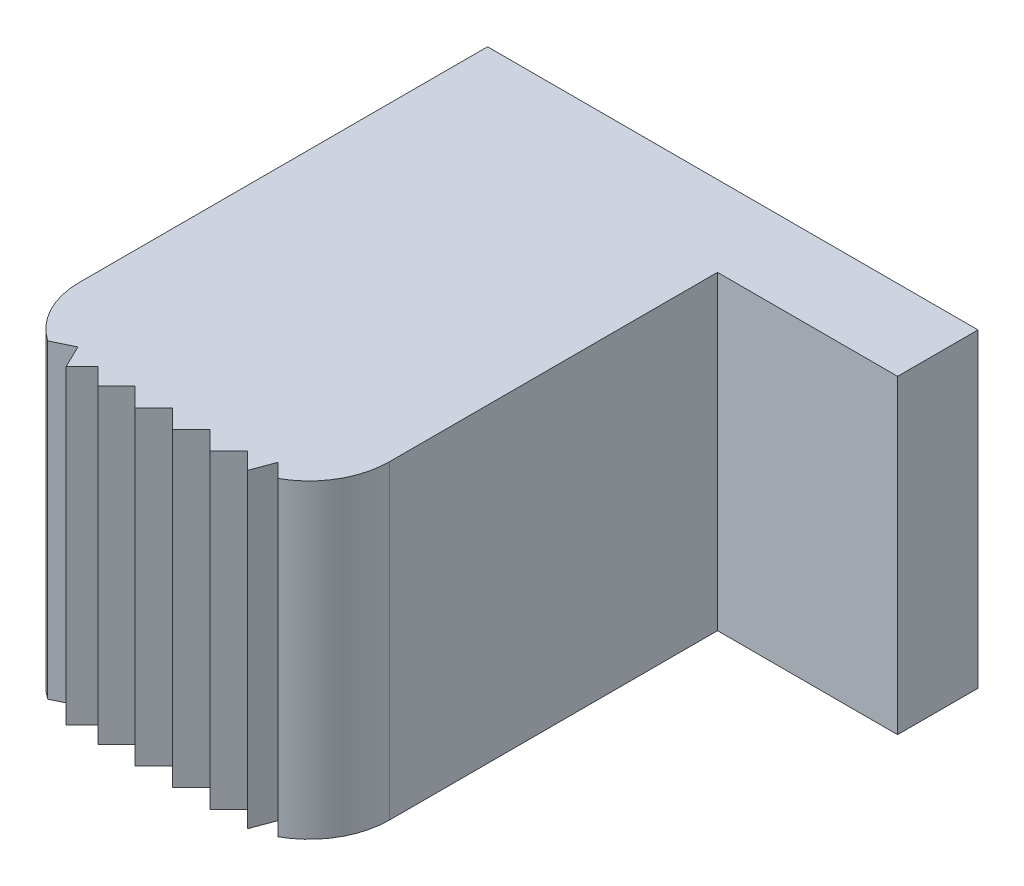
ISO-10303-21;
HEADER;
FILE_DESCRIPTION(('STEP AP214'),'2;1');
FILE_NAME('part.step','',(''),(''),'','','');
FILE_SCHEMA(('AUTOMOTIVE_DESIGN { 1 0 10303 214 1 1 1 1 }'));
ENDSEC;
DATA;
#1=APPLICATION_CONTEXT('core data for automotive mechanical design processes');
#2=APPLICATION_PROTOCOL_DEFINITION('international standard','automotive_design',2000,#1);
#3=PRODUCT_CONTEXT('',#1,'mechanical');
#4=PRODUCT('Part','Part','',(#3));
#5=PRODUCT_RELATED_PRODUCT_CATEGORY('part','',(#4));
#6=PRODUCT_DEFINITION_FORMATION('','',#4);
#7=PRODUCT_DEFINITION_CONTEXT('part definition',#1,'design');
#8=PRODUCT_DEFINITION('design','',#6,#7);
#9=PRODUCT_DEFINITION_SHAPE('','',#8);
#10=(LENGTH_UNIT() NAMED_UNIT(*) SI_UNIT(.MILLI.,.METRE.));
#11=(NAMED_UNIT(*) PLANE_ANGLE_UNIT() SI_UNIT($,.RADIAN.));
#12=(NAMED_UNIT(*) SI_UNIT($,.STERADIAN.) SOLID_ANGLE_UNIT());
#13=UNCERTAINTY_MEASURE_WITH_UNIT(LENGTH_MEASURE(1.E-05),#10,'distance_accuracy_value','');
#14=(GEOMETRIC_REPRESENTATION_CONTEXT(3) GLOBAL_UNCERTAINTY_ASSIGNED_CONTEXT((#13)) GLOBAL_UNIT_ASSIGNED_CONTEXT((#10,
#11,#12)) REPRESENTATION_CONTEXT('',''));
#15=CARTESIAN_POINT('',(0.,0.,0.));
#16=DIRECTION('',(0.,0.,1.));
#17=DIRECTION('',(1.,0.,0.));
#18=AXIS2_PLACEMENT_3D('',#15,#16,#17);
#19=CARTESIAN_POINT('',(-1.1200687266404,-1.93,5.84761240376454));
#20=DIRECTION('',(-0.707106781186547,0.,-0.707106781186548));
#21=DIRECTION('',(-0.707106781186548,0.,0.707106781186547));
#22=AXIS2_PLACEMENT_3D('',#19,#20,#21);
#23=PLANE('',#22);
#24=DIRECTION('',(0.,1.,0.));
#25=VECTOR('',#24,1.);
#26=CARTESIAN_POINT('',(-1.35245632287586,-1.93,6.08));
#27=LINE('',#26,#25);
#28=CARTESIAN_POINT('',(-1.35245632287586,1.93,6.08));
#29=VERTEX_POINT('',#28);
#30=CARTESIAN_POINT('',(-1.35245632287586,-1.93,6.08));
#31=VERTEX_POINT('',#30);
#32=EDGE_CURVE('E214',#29,#31,#27,.F.);
#33=ORIENTED_EDGE('',*,*,#32,.T.);
#34=DIRECTION('',(-0.707106781186548,0.,0.707106781186547));
#35=VECTOR('',#34,1.);
#36=CARTESIAN_POINT('',(-1.1200687266404,-1.93,5.84761240376454));
#37=LINE('',#36,#35);
#38=CARTESIAN_POINT('',(-1.1200687266404,-1.93,5.84761240376454));
#39=VERTEX_POINT('',#38);
#40=EDGE_CURVE('E206',#39,#31,#37,.T.);
#41=ORIENTED_EDGE('',*,*,#40,.F.);
#42=DIRECTION('',(0.,1.,0.));
#43=VECTOR('',#42,1.);
#44=CARTESIAN_POINT('',(-1.1200687266404,-1.93,5.84761240376454));
#45=LINE('',#44,#43);
#46=CARTESIAN_POINT('',(-1.1200687266404,1.93,5.84761240376454));
#47=VERTEX_POINT('',#46);
#48=EDGE_CURVE('E199',#39,#47,#45,.T.);
#49=ORIENTED_EDGE('',*,*,#48,.T.);
#50=DIRECTION('',(-0.707106781186548,0.,0.707106781186547));
#51=VECTOR('',#50,1.);
#52=CARTESIAN_POINT('',(-1.1200687266404,1.93,5.84761240376454));
#53=LINE('',#52,#51);
#54=EDGE_CURVE('E208',#29,#47,#53,.F.);
#55=ORIENTED_EDGE('',*,*,#54,.F.);
#56=EDGE_LOOP('',(#33,#41,#49,#55));
#57=FACE_BOUND('',#56,.T.);
#58=ADVANCED_FACE('F16',(#57),#23,.F.);
#59=CARTESIAN_POINT('',(-0.887681130404932,-1.93,6.08));
#60=DIRECTION('',(0.707106781186546,0.,-0.707106781186549));
#61=DIRECTION('',(-0.707106781186549,0.,-0.707106781186546));
#62=AXIS2_PLACEMENT_3D('',#59,#60,#61);
#63=PLANE('',#62);
#64=ORIENTED_EDGE('',*,*,#48,.F.);
#65=DIRECTION('',(-0.707106781186549,0.,-0.707106781186546));
#66=VECTOR('',#65,1.);
#67=CARTESIAN_POINT('',(-0.887681130404932,-1.93,6.08));
#68=LINE('',#67,#66);
#69=CARTESIAN_POINT('',(-0.887681130404932,-1.93,6.08));
#70=VERTEX_POINT('',#69);
#71=EDGE_CURVE('E203',#70,#39,#68,.T.);
#72=ORIENTED_EDGE('',*,*,#71,.F.);
#73=DIRECTION('',(0.,1.,0.));
#74=VECTOR('',#73,1.);
#75=CARTESIAN_POINT('',(-0.887681130404932,-1.93,6.08));
#76=LINE('',#75,#74);
#77=CARTESIAN_POINT('',(-0.887681130404932,1.93,6.08));
#78=VERTEX_POINT('',#77);
#79=EDGE_CURVE('E226',#70,#78,#76,.T.);
#80=ORIENTED_EDGE('',*,*,#79,.T.);
#81=DIRECTION('',(-0.707106781186549,0.,-0.707106781186546));
#82=VECTOR('',#81,1.);
#83=CARTESIAN_POINT('',(-0.887681130404932,1.93,6.08));
#84=LINE('',#83,#82);
#85=EDGE_CURVE('E202',#47,#78,#84,.F.);
#86=ORIENTED_EDGE('',*,*,#85,.F.);
#87=EDGE_LOOP('',(#64,#72,#80,#86));
#88=FACE_BOUND('',#87,.T.);
#89=ADVANCED_FACE('F517',(#88),#63,.F.);
#90=CARTESIAN_POINT('',(-1.35245632287586,-1.93,6.08));
#91=DIRECTION('',(0.707106781186548,0.,-0.707106781186548));
#92=DIRECTION('',(-0.707106781186548,0.,-0.707106781186548));
#93=AXIS2_PLACEMENT_3D('',#90,#91,#92);
#94=PLANE('',#93);
#95=DIRECTION('',(0.,1.,0.));
#96=VECTOR('',#95,1.);
#97=CARTESIAN_POINT('',(-1.58484391911133,-1.93,5.84761240376454));
#98=LINE('',#97,#96);
#99=CARTESIAN_POINT('',(-1.58484391911133,1.93,5.84761240376454));
#100=VERTEX_POINT('',#99);
#101=CARTESIAN_POINT('',(-1.58484391911133,-1.93,5.84761240376454));
#102=VERTEX_POINT('',#101);
#103=EDGE_CURVE('E241',#100,#102,#98,.F.);
#104=ORIENTED_EDGE('',*,*,#103,.T.);
#105=DIRECTION('',(-0.707106781186548,0.,-0.707106781186548));
#106=VECTOR('',#105,1.);
#107=CARTESIAN_POINT('',(-1.35245632287586,-1.93,6.08));
#108=LINE('',#107,#106);
#109=EDGE_CURVE('E217',#31,#102,#108,.T.);
#110=ORIENTED_EDGE('',*,*,#109,.F.);
#111=ORIENTED_EDGE('',*,*,#32,.F.);
#112=DIRECTION('',(-0.707106781186548,0.,-0.707106781186548));
#113=VECTOR('',#112,1.);
#114=CARTESIAN_POINT('',(-1.35245632287586,1.93,6.08));
#115=LINE('',#114,#113);
#116=EDGE_CURVE('E234',#100,#29,#115,.F.);
#117=ORIENTED_EDGE('',*,*,#116,.F.);
#118=EDGE_LOOP('',(#104,#110,#111,#117));
#119=FACE_BOUND('',#118,.T.);
#120=ADVANCED_FACE('F514',(#119),#94,.F.);
#121=CARTESIAN_POINT('',(-0.655293534169467,-1.93,5.84761240376454));
#122=DIRECTION('',(-0.707106781186547,0.,-0.707106781186548));
#123=DIRECTION('',(-0.707106781186548,0.,0.707106781186547));
#124=AXIS2_PLACEMENT_3D('',#121,#122,#123);
#125=PLANE('',#124);
#126=ORIENTED_EDGE('',*,*,#79,.F.);
#127=DIRECTION('',(-0.707106781186548,0.,0.707106781186547));
#128=VECTOR('',#127,1.);
#129=CARTESIAN_POINT('',(-0.655293534169467,-1.93,5.84761240376454));
#130=LINE('',#129,#128);
#131=CARTESIAN_POINT('',(-0.655293534169467,-1.93,5.84761240376454));
#132=VERTEX_POINT('',#131);
#133=EDGE_CURVE('E230',#132,#70,#130,.T.);
#134=ORIENTED_EDGE('',*,*,#133,.F.);
#135=DIRECTION('',(0.,1.,0.));
#136=VECTOR('',#135,1.);
#137=CARTESIAN_POINT('',(-0.655293534169467,-1.93,5.84761240376454));
#138=LINE('',#137,#136);
#139=CARTESIAN_POINT('',(-0.655293534169467,1.93,5.84761240376454));
#140=VERTEX_POINT('',#139);
#141=EDGE_CURVE('E253',#132,#140,#138,.T.);
#142=ORIENTED_EDGE('',*,*,#141,.T.);
#143=DIRECTION('',(-0.707106781186548,0.,0.707106781186547));
#144=VECTOR('',#143,1.);
#145=CARTESIAN_POINT('',(-0.655293534169467,1.93,5.84761240376454));
#146=LINE('',#145,#144);
#147=EDGE_CURVE('E229',#78,#140,#146,.F.);
#148=ORIENTED_EDGE('',*,*,#147,.F.);
#149=EDGE_LOOP('',(#126,#134,#142,#148));
#150=FACE_BOUND('',#149,.T.);
#151=ADVANCED_FACE('F510',(#150),#125,.F.);
#152=CARTESIAN_POINT('',(-1.58484391911133,-1.93,5.84761240376454));
#153=DIRECTION('',(-0.707106781186548,0.,-0.707106781186547));
#154=DIRECTION('',(-0.707106781186547,0.,0.707106781186548));
#155=AXIS2_PLACEMENT_3D('',#152,#153,#154);
#156=PLANE('',#155);
#157=DIRECTION('',(0.,1.,0.));
#158=VECTOR('',#157,1.);
#159=CARTESIAN_POINT('',(-1.81723151534679,-1.93,6.08));
#160=LINE('',#159,#158);
#161=CARTESIAN_POINT('',(-1.81723151534679,1.93,6.08));
#162=VERTEX_POINT('',#161);
#163=CARTESIAN_POINT('',(-1.81723151534679,-1.93,6.08));
#164=VERTEX_POINT('',#163);
#165=EDGE_CURVE('E268',#162,#164,#160,.F.);
#166=ORIENTED_EDGE('',*,*,#165,.T.);
#167=DIRECTION('',(-0.707106781186547,0.,0.707106781186548));
#168=VECTOR('',#167,1.);
#169=CARTESIAN_POINT('',(-1.58484391911133,-1.93,5.84761240376454));
#170=LINE('',#169,#168);
#171=EDGE_CURVE('E244',#102,#164,#170,.T.);
#172=ORIENTED_EDGE('',*,*,#171,.F.);
#173=ORIENTED_EDGE('',*,*,#103,.F.);
#174=DIRECTION('',(-0.707106781186547,0.,0.707106781186548));
#175=VECTOR('',#174,1.);
#176=CARTESIAN_POINT('',(-1.58484391911133,1.93,5.84761240376454));
#177=LINE('',#176,#175);
#178=EDGE_CURVE('E261',#162,#100,#177,.F.);
#179=ORIENTED_EDGE('',*,*,#178,.F.);
#180=EDGE_LOOP('',(#166,#172,#173,#179));
#181=FACE_BOUND('',#180,.T.);
#182=ADVANCED_FACE('F506',(#181),#156,.F.);
#183=CARTESIAN_POINT('',(-0.422905937934001,-1.93,6.08));
#184=DIRECTION('',(0.707106781186547,0.,-0.707106781186548));
#185=DIRECTION('',(-0.707106781186548,0.,-0.707106781186547));
#186=AXIS2_PLACEMENT_3D('',#183,#184,#185);
#187=PLANE('',#186);
#188=ORIENTED_EDGE('',*,*,#141,.F.);
#189=DIRECTION('',(-0.707106781186548,0.,-0.707106781186547));
#190=VECTOR('',#189,1.);
#191=CARTESIAN_POINT('',(-0.422905937934001,-1.93,6.08));
#192=LINE('',#191,#190);
#193=CARTESIAN_POINT('',(-0.422905937934001,-1.93,6.08));
#194=VERTEX_POINT('',#193);
#195=EDGE_CURVE('E257',#194,#132,#192,.T.);
#196=ORIENTED_EDGE('',*,*,#195,.F.);
#197=DIRECTION('',(0.,1.,0.));
#198=VECTOR('',#197,1.);
#199=CARTESIAN_POINT('',(-0.422905937934001,-1.93,6.08));
#200=LINE('',#199,#198);
#201=CARTESIAN_POINT('',(-0.422905937934001,1.93,6.08));
#202=VERTEX_POINT('',#201);
#203=EDGE_CURVE('E280',#194,#202,#200,.T.);
#204=ORIENTED_EDGE('',*,*,#203,.T.);
#205=DIRECTION('',(-0.707106781186548,0.,-0.707106781186547));
#206=VECTOR('',#205,1.);
#207=CARTESIAN_POINT('',(-0.422905937934001,1.93,6.08));
#208=LINE('',#207,#206);
#209=EDGE_CURVE('E256',#140,#202,#208,.F.);
#210=ORIENTED_EDGE('',*,*,#209,.F.);
#211=EDGE_LOOP('',(#188,#196,#204,#210));
#212=FACE_BOUND('',#211,.T.);
#213=ADVANCED_FACE('F502',(#212),#187,.F.);
#214=CARTESIAN_POINT('',(-1.81723151534679,-1.93,6.08));
#215=DIRECTION('',(0.707106781186548,0.,-0.707106781186547));
#216=DIRECTION('',(-0.707106781186547,0.,-0.707106781186548));
#217=AXIS2_PLACEMENT_3D('',#214,#215,#216);
#218=PLANE('',#217);
#219=DIRECTION('',(0.,1.,0.));
#220=VECTOR('',#219,1.);
#221=CARTESIAN_POINT('',(-2.02984114288925,-1.93,5.86739037245754));
#222=LINE('',#221,#220);
#223=CARTESIAN_POINT('',(-2.02984114288925,1.93,5.86739037245754));
#224=VERTEX_POINT('',#223);
#225=CARTESIAN_POINT('',(-2.02984114288925,-1.93,5.86739037245754));
#226=VERTEX_POINT('',#225);
#227=EDGE_CURVE('E295',#224,#226,#222,.F.);
#228=ORIENTED_EDGE('',*,*,#227,.T.);
#229=DIRECTION('',(-0.707106781186547,0.,-0.707106781186548));
#230=VECTOR('',#229,1.);
#231=CARTESIAN_POINT('',(-1.81723151534679,-1.93,6.08));
#232=LINE('',#231,#230);
#233=EDGE_CURVE('E271',#164,#226,#232,.T.);
#234=ORIENTED_EDGE('',*,*,#233,.F.);
#235=ORIENTED_EDGE('',*,*,#165,.F.);
#236=DIRECTION('',(-0.707106781186547,0.,-0.707106781186548));
#237=VECTOR('',#236,1.);
#238=CARTESIAN_POINT('',(-1.81723151534679,1.93,6.08));
#239=LINE('',#238,#237);
#240=EDGE_CURVE('E288',#224,#162,#239,.F.);
#241=ORIENTED_EDGE('',*,*,#240,.F.);
#242=EDGE_LOOP('',(#228,#234,#235,#241));
#243=FACE_BOUND('',#242,.T.);
#244=ADVANCED_FACE('F498',(#243),#218,.F.);
#245=CARTESIAN_POINT('',(-0.190518341698535,-1.93,5.84761240376454));
#246=DIRECTION('',(-0.707106781186546,0.,-0.707106781186549));
#247=DIRECTION('',(-0.707106781186549,0.,0.707106781186546));
#248=AXIS2_PLACEMENT_3D('',#245,#246,#247);
#249=PLANE('',#248);
#250=ORIENTED_EDGE('',*,*,#203,.F.);
#251=DIRECTION('',(-0.707106781186549,0.,0.707106781186546));
#252=VECTOR('',#251,1.);
#253=CARTESIAN_POINT('',(-0.190518341698535,-1.93,5.84761240376454));
#254=LINE('',#253,#252);
#255=CARTESIAN_POINT('',(-0.190518341698535,-1.93,5.84761240376454));
#256=VERTEX_POINT('',#255);
#257=EDGE_CURVE('E284',#256,#194,#254,.T.);
#258=ORIENTED_EDGE('',*,*,#257,.F.);
#259=DIRECTION('',(0.,1.,0.));
#260=VECTOR('',#259,1.);
#261=CARTESIAN_POINT('',(-0.190518341698535,-1.93,5.84761240376454));
#262=LINE('',#261,#260);
#263=CARTESIAN_POINT('',(-0.190518341698535,1.93,5.84761240376454));
#264=VERTEX_POINT('',#263);
#265=EDGE_CURVE('E307',#256,#264,#262,.T.);
#266=ORIENTED_EDGE('',*,*,#265,.T.);
#267=DIRECTION('',(-0.707106781186549,0.,0.707106781186546));
#268=VECTOR('',#267,1.);
#269=CARTESIAN_POINT('',(-0.190518341698535,1.93,5.84761240376454));
#270=LINE('',#269,#268);
#271=EDGE_CURVE('E283',#202,#264,#270,.F.);
#272=ORIENTED_EDGE('',*,*,#271,.F.);
#273=EDGE_LOOP('',(#250,#258,#266,#272));
#274=FACE_BOUND('',#273,.T.);
#275=ADVANCED_FACE('F494',(#274),#249,.F.);
#276=CARTESIAN_POINT('',(-2.02984114288925,-1.93,5.86739037245754));
#277=DIRECTION('',(-0.707106781186547,0.,-0.707106781186548));
#278=DIRECTION('',(-0.707106781186548,0.,0.707106781186547));
#279=AXIS2_PLACEMENT_3D('',#276,#277,#278);
#280=PLANE('',#279);
#281=DIRECTION('',(0.,1.,0.));
#282=VECTOR('',#281,1.);
#283=CARTESIAN_POINT('',(-2.22671316786361,-1.93,6.06426239199901));
#284=LINE('',#283,#282);
#285=CARTESIAN_POINT('',(-2.22671316727436,1.93,6.06426239322072));
#286=VERTEX_POINT('',#285);
#287=CARTESIAN_POINT('',(-2.22671316727436,-1.93,6.06426239322072));
#288=VERTEX_POINT('',#287);
#289=EDGE_CURVE('E322',#286,#288,#284,.F.);
#290=ORIENTED_EDGE('',*,*,#289,.T.);
#291=DIRECTION('',(-0.707106781186548,0.,0.707106781186547));
#292=VECTOR('',#291,1.);
#293=CARTESIAN_POINT('',(-2.02984114288925,-1.93,5.86739037245754));
#294=LINE('',#293,#292);
#295=EDGE_CURVE('E298',#226,#288,#294,.T.);
#296=ORIENTED_EDGE('',*,*,#295,.F.);
#297=ORIENTED_EDGE('',*,*,#227,.F.);
#298=DIRECTION('',(-0.707106781186548,0.,0.707106781186547));
#299=VECTOR('',#298,1.);
#300=CARTESIAN_POINT('',(-2.02984114288925,1.93,5.86739037245754));
#301=LINE('',#300,#299);
#302=EDGE_CURVE('E315',#286,#224,#301,.F.);
#303=ORIENTED_EDGE('',*,*,#302,.F.);
#304=EDGE_LOOP('',(#290,#296,#297,#303));
#305=FACE_BOUND('',#304,.T.);
#306=ADVANCED_FACE('F490',(#305),#280,.F.);
#307=CARTESIAN_POINT('',(0.019646600468707,-1.93,6.05777734593178));
#308=DIRECTION('',(0.707106781186548,0.,-0.707106781186548));
#309=DIRECTION('',(-0.707106781186548,0.,-0.707106781186548));
#310=AXIS2_PLACEMENT_3D('',#307,#308,#309);
#311=PLANE('',#310);
#312=ORIENTED_EDGE('',*,*,#265,.F.);
#313=DIRECTION('',(-0.707106781186548,0.,-0.707106781186548));
#314=VECTOR('',#313,1.);
#315=CARTESIAN_POINT('',(0.019646600468707,-1.93,6.05777734593178));
#316=LINE('',#315,#314);
#317=CARTESIAN_POINT('',(0.0196466004687076,-1.93,6.05777734593178));
#318=VERTEX_POINT('',#317);
#319=EDGE_CURVE('E311',#318,#256,#316,.T.);
#320=ORIENTED_EDGE('',*,*,#319,.F.);
#321=DIRECTION('',(0.,1.,0.));
#322=VECTOR('',#321,1.);
#323=CARTESIAN_POINT('',(0.0196466004687077,-1.93,6.05777734593178));
#324=LINE('',#323,#322);
#325=CARTESIAN_POINT('',(0.0196465674412596,1.93,6.05777731290433));
#326=VERTEX_POINT('',#325);
#327=EDGE_CURVE('E334',#318,#326,#324,.T.);
#328=ORIENTED_EDGE('',*,*,#327,.T.);
#329=DIRECTION('',(-0.707106781186548,0.,-0.707106781186548));
#330=VECTOR('',#329,1.);
#331=CARTESIAN_POINT('',(0.019646600468707,1.93,6.05777734593178));
#332=LINE('',#331,#330);
#333=EDGE_CURVE('E310',#264,#326,#332,.F.);
#334=ORIENTED_EDGE('',*,*,#333,.F.);
#335=EDGE_LOOP('',(#312,#320,#328,#334));
#336=FACE_BOUND('',#335,.T.);
#337=ADVANCED_FACE('F486',(#336),#311,.F.);
#338=CARTESIAN_POINT('',(-2.22671316609586,-1.93,6.06426239566415));
#339=DIRECTION('',(0.900708019142965,0.,-0.434424981155039));
#340=DIRECTION('',(-0.434424981155039,0.,-0.900708019142965));
#341=AXIS2_PLACEMENT_3D('',#338,#339,#340);
#342=PLANE('',#341);
#343=DIRECTION('',(0.,1.,0.));
#344=VECTOR('',#343,1.);
#345=CARTESIAN_POINT('',(-2.36348883081681,-1.93,5.78068078000701));
#346=LINE('',#345,#344);
#347=CARTESIAN_POINT('',(-2.36348883081681,1.93,5.78068078000701));
#348=VERTEX_POINT('',#347);
#349=CARTESIAN_POINT('',(-2.36348883081681,-1.93,5.78068078000701));
#350=VERTEX_POINT('',#349);
#351=EDGE_CURVE('E348',#348,#350,#346,.F.);
#352=ORIENTED_EDGE('',*,*,#351,.T.);
#353=DIRECTION('',(-0.434424981155039,0.,-0.900708019142965));
#354=VECTOR('',#353,1.);
#355=CARTESIAN_POINT('',(-2.22671316609586,-1.93,6.06426239566415));
#356=LINE('',#355,#354);
#357=EDGE_CURVE('E325',#288,#350,#356,.T.);
#358=ORIENTED_EDGE('',*,*,#357,.F.);
#359=ORIENTED_EDGE('',*,*,#289,.F.);
#360=DIRECTION('',(-0.434424981155039,0.,-0.900708019142965));
#361=VECTOR('',#360,1.);
#362=CARTESIAN_POINT('',(-2.22671316609586,1.93,6.06426239566415));
#363=LINE('',#362,#361);
#364=EDGE_CURVE('E341',#348,#286,#363,.F.);
#365=ORIENTED_EDGE('',*,*,#364,.F.);
#366=EDGE_LOOP('',(#352,#358,#359,#365));
#367=FACE_BOUND('',#366,.T.);
#368=ADVANCED_FACE('F482',(#367),#342,.F.);
#369=CARTESIAN_POINT('',(0.122918057515651,-1.93,5.78093586846002));
#370=DIRECTION('',(-0.936933185481823,0.,-0.349508520558346));
#371=DIRECTION('',(-0.349508520558346,0.,0.936933185481823));
#372=AXIS2_PLACEMENT_3D('',#369,#370,#371);
#373=PLANE('',#372);
#374=ORIENTED_EDGE('',*,*,#327,.F.);
#375=DIRECTION('',(-0.349508520558346,0.,0.936933185481823));
#376=VECTOR('',#375,1.);
#377=CARTESIAN_POINT('',(0.122918057515651,-1.93,5.78093586846002));
#378=LINE('',#377,#376);
#379=CARTESIAN_POINT('',(0.122918057515651,-1.93,5.78093586846002));
#380=VERTEX_POINT('',#379);
#381=EDGE_CURVE('E337',#380,#318,#378,.T.);
#382=ORIENTED_EDGE('',*,*,#381,.F.);
#383=DIRECTION('',(0.,1.,0.));
#384=VECTOR('',#383,1.);
#385=CARTESIAN_POINT('',(0.122918057515651,-1.93,5.78093586846002));
#386=LINE('',#385,#384);
#387=CARTESIAN_POINT('',(0.122918057515651,1.93,5.78093586846002));
#388=VERTEX_POINT('',#387);
#389=EDGE_CURVE('E178',#380,#388,#386,.T.);
#390=ORIENTED_EDGE('',*,*,#389,.T.);
#391=DIRECTION('',(-0.349508520558346,0.,0.936933185481823));
#392=VECTOR('',#391,1.);
#393=CARTESIAN_POINT('',(0.122918057515651,1.93,5.78093586846002));
#394=LINE('',#393,#392);
#395=EDGE_CURVE('E173',#326,#388,#394,.F.);
#396=ORIENTED_EDGE('',*,*,#395,.F.);
#397=EDGE_LOOP('',(#374,#382,#390,#396));
#398=FACE_BOUND('',#397,.T.);
#399=ADVANCED_FACE('F478',(#398),#373,.F.);
#400=CARTESIAN_POINT('',(-2.36348883081681,-1.93,5.78068078000701));
#401=DIRECTION('',(-0.434424983543835,0.,-0.900708017990813));
#402=DIRECTION('',(-0.900708017990813,0.,0.434424983543835));
#403=AXIS2_PLACEMENT_3D('',#400,#401,#402);
#404=PLANE('',#403);
#405=DIRECTION('',(0.,-1.,0.));
#406=VECTOR('',#405,1.);
#407=CARTESIAN_POINT('',(-2.61765296171704,0.965,5.90326794851608));
#408=LINE('',#407,#406);
#409=CARTESIAN_POINT('',(-2.61765296038832,-1.93,5.90326794943225));
#410=VERTEX_POINT('',#409);
#411=CARTESIAN_POINT('',(-2.61765296038832,1.93,5.90326794943225));
#412=VERTEX_POINT('',#411);
#413=EDGE_CURVE('E177',#410,#412,#408,.F.);
#414=ORIENTED_EDGE('',*,*,#413,.F.);
#415=DIRECTION('',(-0.900708017990813,0.,0.434424983543835));
#416=VECTOR('',#415,1.);
#417=CARTESIAN_POINT('',(-2.36348883081681,-1.93,5.78068078000701));
#418=LINE('',#417,#416);
#419=EDGE_CURVE('E351',#350,#410,#418,.T.);
#420=ORIENTED_EDGE('',*,*,#419,.F.);
#421=ORIENTED_EDGE('',*,*,#351,.F.);
#422=DIRECTION('',(-0.900708017990813,0.,0.434424983543835));
#423=VECTOR('',#422,1.);
#424=CARTESIAN_POINT('',(-2.36348883081681,1.93,5.78068078000701));
#425=LINE('',#424,#423);
#426=EDGE_CURVE('E363',#412,#348,#425,.F.);
#427=ORIENTED_EDGE('',*,*,#426,.F.);
#428=EDGE_LOOP('',(#414,#420,#421,#427));
#429=FACE_BOUND('',#428,.T.);
#430=ADVANCED_FACE('F475',(#429),#404,.F.);
#431=CARTESIAN_POINT('',(0.295962082583547,-1.93,5.95397989352791));
#432=DIRECTION('',(0.707106781186546,0.,-0.707106781186549));
#433=DIRECTION('',(-0.707106781186549,0.,-0.707106781186546));
#434=AXIS2_PLACEMENT_3D('',#431,#432,#433);
#435=PLANE('',#434);
#436=ORIENTED_EDGE('',*,*,#389,.F.);
#437=DIRECTION('',(-0.707106781186549,0.,-0.707106781186546));
#438=VECTOR('',#437,1.);
#439=CARTESIAN_POINT('',(0.295962082583547,-1.93,5.95397989352791));
#440=LINE('',#439,#438);
#441=CARTESIAN_POINT('',(0.295962082583547,-1.93,5.95397989352791));
#442=VERTEX_POINT('',#441);
#443=EDGE_CURVE('E183',#442,#380,#440,.T.);
#444=ORIENTED_EDGE('',*,*,#443,.F.);
#445=DIRECTION('',(0.,1.,0.));
#446=VECTOR('',#445,1.);
#447=CARTESIAN_POINT('',(0.295962082583547,-0.965,5.95397989352791));
#448=LINE('',#447,#446);
#449=CARTESIAN_POINT('',(0.295962082583547,1.93,5.95397989352791));
#450=VERTEX_POINT('',#449);
#451=EDGE_CURVE('E181',#450,#442,#448,.F.);
#452=ORIENTED_EDGE('',*,*,#451,.F.);
#453=DIRECTION('',(-0.707106781186549,0.,-0.707106781186546));
#454=VECTOR('',#453,1.);
#455=CARTESIAN_POINT('',(0.295962082583547,1.93,5.95397989352791));
#456=LINE('',#455,#454);
#457=EDGE_CURVE('E165',#388,#450,#456,.F.);
#458=ORIENTED_EDGE('',*,*,#457,.F.);
#459=EDGE_LOOP('',(#436,#444,#452,#458));
#460=FACE_BOUND('',#459,.T.);
#461=ADVANCED_FACE('F182',(#460),#435,.F.);
#462=CARTESIAN_POINT('',(-2.05,0.965,5.08));
#463=DIRECTION('',(0.,-1.,0.));
#464=DIRECTION('',(0.,0.,-1.));
#465=AXIS2_PLACEMENT_3D('',#462,#463,#464);
#466=CYLINDRICAL_SURFACE('',#465,1.);
#467=DIRECTION('',(0.,1.,0.));
#468=VECTOR('',#467,1.);
#469=CARTESIAN_POINT('',(-3.05,1.93,5.08));
#470=LINE('',#469,#468);
#471=CARTESIAN_POINT('',(-3.05,-1.93,5.08));
#472=VERTEX_POINT('',#471);
#473=CARTESIAN_POINT('',(-3.05,1.93,5.08));
#474=VERTEX_POINT('',#473);
#475=EDGE_CURVE('E196',#472,#474,#470,.T.);
#476=ORIENTED_EDGE('',*,*,#475,.F.);
#477=CARTESIAN_POINT('',(-2.05,-1.93,5.08));
#478=DIRECTION('',(0.,-1.,0.));
#479=DIRECTION('',(0.,0.,-1.));
#480=AXIS2_PLACEMENT_3D('',#477,#478,#479);
#481=CIRCLE('',#480,1.);
#482=EDGE_CURVE('E19',#472,#410,#481,.F.);
#483=ORIENTED_EDGE('',*,*,#482,.T.);
#484=ORIENTED_EDGE('',*,*,#413,.T.);
#485=CARTESIAN_POINT('',(-2.05,1.93,5.08));
#486=DIRECTION('',(0.,-1.,0.));
#487=DIRECTION('',(0.,0.,-1.));
#488=AXIS2_PLACEMENT_3D('',#485,#486,#487);
#489=CIRCLE('',#488,1.);
#490=EDGE_CURVE('E191',#474,#412,#489,.F.);
#491=ORIENTED_EDGE('',*,*,#490,.F.);
#492=EDGE_LOOP('',(#476,#483,#484,#491));
#493=FACE_BOUND('',#492,.T.);
#494=ADVANCED_FACE('F469',(#493),#466,.T.);
#495=CARTESIAN_POINT('',(3.05,-1.93,0.));
#496=DIRECTION('',(1.,0.,0.));
#497=DIRECTION('',(0.,0.,-1.));
#498=AXIS2_PLACEMENT_3D('',#495,#496,#497);
#499=PLANE('',#498);
#500=DIRECTION('',(0.,1.,0.));
#501=VECTOR('',#500,1.);
#502=CARTESIAN_POINT('',(3.05,0.,1.));
#503=LINE('',#502,#501);
#504=CARTESIAN_POINT('',(3.05,-1.93,1.));
#505=VERTEX_POINT('',#504);
#506=CARTESIAN_POINT('',(3.05,1.93,1.));
#507=VERTEX_POINT('',#506);
#508=EDGE_CURVE('E398',#505,#507,#503,.T.);
#509=ORIENTED_EDGE('',*,*,#508,.F.);
#510=DIRECTION('',(0.,0.,-1.));
#511=VECTOR('',#510,1.);
#512=CARTESIAN_POINT('',(3.05,-1.93,0.));
#513=LINE('',#512,#511);
#514=CARTESIAN_POINT('',(3.05,-1.93,0.));
#515=VERTEX_POINT('',#514);
#516=EDGE_CURVE('E184',#505,#515,#513,.T.);
#517=ORIENTED_EDGE('',*,*,#516,.T.);
#518=DIRECTION('',(0.,1.,0.));
#519=VECTOR('',#518,1.);
#520=CARTESIAN_POINT('',(3.05,0.,0.));
#521=LINE('',#520,#519);
#522=CARTESIAN_POINT('',(3.05,1.93,0.));
#523=VERTEX_POINT('',#522);
#524=EDGE_CURVE('E378',#515,#523,#521,.T.);
#525=ORIENTED_EDGE('',*,*,#524,.T.);
#526=DIRECTION('',(0.,0.,1.));
#527=VECTOR('',#526,1.);
#528=CARTESIAN_POINT('',(3.05,1.93,0.));
#529=LINE('',#528,#527);
#530=EDGE_CURVE('E188',#507,#523,#529,.F.);
#531=ORIENTED_EDGE('',*,*,#530,.F.);
#532=EDGE_LOOP('',(#509,#517,#525,#531));
#533=FACE_BOUND('',#532,.T.);
#534=ADVANCED_FACE('F443',(#533),#499,.T.);
#535=CARTESIAN_POINT('',(-0.190000000000002,-0.965,5.08));
#536=DIRECTION('',(0.,1.,0.));
#537=DIRECTION('',(0.,0.,1.));
#538=AXIS2_PLACEMENT_3D('',#535,#536,#537);
#539=CYLINDRICAL_SURFACE('',#538,1.);
#540=DIRECTION('',(0.,1.,0.));
#541=VECTOR('',#540,1.);
#542=CARTESIAN_POINT('',(0.809999999999999,-1.93,5.08));
#543=LINE('',#542,#541);
#544=CARTESIAN_POINT('',(0.809999999999999,1.93,5.08));
#545=VERTEX_POINT('',#544);
#546=CARTESIAN_POINT('',(0.809999999999999,-1.93,5.08));
#547=VERTEX_POINT('',#546);
#548=EDGE_CURVE('E187',#545,#547,#543,.F.);
#549=ORIENTED_EDGE('',*,*,#548,.F.);
#550=CARTESIAN_POINT('',(-0.190000000000002,1.93,5.08));
#551=DIRECTION('',(0.,1.,0.));
#552=DIRECTION('',(0.,0.,1.));
#553=AXIS2_PLACEMENT_3D('',#550,#551,#552);
#554=CIRCLE('',#553,1.);
#555=EDGE_CURVE('E170',#450,#545,#554,.T.);
#556=ORIENTED_EDGE('',*,*,#555,.F.);
#557=ORIENTED_EDGE('',*,*,#451,.T.);
#558=CARTESIAN_POINT('',(-0.190000000000002,-1.93,5.08));
#559=DIRECTION('',(0.,1.,0.));
#560=DIRECTION('',(0.,0.,1.));
#561=AXIS2_PLACEMENT_3D('',#558,#559,#560);
#562=CIRCLE('',#561,1.);
#563=EDGE_CURVE('E34',#442,#547,#562,.T.);
#564=ORIENTED_EDGE('',*,*,#563,.T.);
#565=EDGE_LOOP('',(#549,#556,#557,#564));
#566=FACE_BOUND('',#565,.T.);
#567=ADVANCED_FACE('F186',(#566),#539,.T.);
#568=CARTESIAN_POINT('',(3.05,1.93,0.));
#569=DIRECTION('',(0.,1.,0.));
#570=DIRECTION('',(0.,0.,1.));
#571=AXIS2_PLACEMENT_3D('',#568,#569,#570);
#572=PLANE('',#571);
#573=DIRECTION('',(0.,0.,1.));
#574=VECTOR('',#573,1.);
#575=CARTESIAN_POINT('',(-3.05,1.93,0.));
#576=LINE('',#575,#574);
#577=CARTESIAN_POINT('',(-3.05,1.93,0.));
#578=VERTEX_POINT('',#577);
#579=EDGE_CURVE('E381',#474,#578,#576,.F.);
#580=ORIENTED_EDGE('',*,*,#579,.F.);
#581=ORIENTED_EDGE('',*,*,#490,.T.);
#582=ORIENTED_EDGE('',*,*,#426,.T.);
#583=ORIENTED_EDGE('',*,*,#364,.T.);
#584=ORIENTED_EDGE('',*,*,#302,.T.);
#585=ORIENTED_EDGE('',*,*,#240,.T.);
#586=ORIENTED_EDGE('',*,*,#178,.T.);
#587=ORIENTED_EDGE('',*,*,#116,.T.);
#588=ORIENTED_EDGE('',*,*,#54,.T.);
#589=ORIENTED_EDGE('',*,*,#85,.T.);
#590=ORIENTED_EDGE('',*,*,#147,.T.);
#591=ORIENTED_EDGE('',*,*,#209,.T.);
#592=ORIENTED_EDGE('',*,*,#271,.T.);
#593=ORIENTED_EDGE('',*,*,#333,.T.);
#594=ORIENTED_EDGE('',*,*,#395,.T.);
#595=ORIENTED_EDGE('',*,*,#457,.T.);
#596=ORIENTED_EDGE('',*,*,#555,.T.);
#597=DIRECTION('',(0.,0.,-1.));
#598=VECTOR('',#597,1.);
#599=CARTESIAN_POINT('',(0.809999999999999,1.93,1.));
#600=LINE('',#599,#598);
#601=CARTESIAN_POINT('',(0.809999999999999,1.93,1.));
#602=VERTEX_POINT('',#601);
#603=EDGE_CURVE('E401',#602,#545,#600,.F.);
#604=ORIENTED_EDGE('',*,*,#603,.F.);
#605=DIRECTION('',(1.,0.,0.));
#606=VECTOR('',#605,1.);
#607=CARTESIAN_POINT('',(0.,1.93,1.));
#608=LINE('',#607,#606);
#609=EDGE_CURVE('E60',#507,#602,#608,.F.);
#610=ORIENTED_EDGE('',*,*,#609,.F.);
#611=ORIENTED_EDGE('',*,*,#530,.T.);
#612=DIRECTION('',(1.,0.,0.));
#613=VECTOR('',#612,1.);
#614=CARTESIAN_POINT('',(0.,1.93,0.));
#615=LINE('',#614,#613);
#616=EDGE_CURVE('E380',#523,#578,#615,.F.);
#617=ORIENTED_EDGE('',*,*,#616,.T.);
#618=EDGE_LOOP('',(#580,#581,#582,#583,#584,#585,#586,#587,#588,#589,#590,#591,#592,#593,#594,
#595,#596,#604,#610,#611,#617));
#619=FACE_BOUND('',#618,.T.);
#620=ADVANCED_FACE('F168',(#619),#572,.T.);
#621=CARTESIAN_POINT('',(-3.05,1.93,0.));
#622=DIRECTION('',(-1.,0.,0.));
#623=DIRECTION('',(0.,0.,1.));
#624=AXIS2_PLACEMENT_3D('',#621,#622,#623);
#625=PLANE('',#624);
#626=DIRECTION('',(0.,1.,0.));
#627=VECTOR('',#626,1.);
#628=CARTESIAN_POINT('',(-3.05,0.,0.));
#629=LINE('',#628,#627);
#630=CARTESIAN_POINT('',(-3.05,-1.93,0.));
#631=VERTEX_POINT('',#630);
#632=EDGE_CURVE('E385',#578,#631,#629,.F.);
#633=ORIENTED_EDGE('',*,*,#632,.T.);
#634=DIRECTION('',(0.,0.,-1.));
#635=VECTOR('',#634,1.);
#636=CARTESIAN_POINT('',(-3.05,-1.93,0.));
#637=LINE('',#636,#635);
#638=EDGE_CURVE('E403',#472,#631,#637,.T.);
#639=ORIENTED_EDGE('',*,*,#638,.F.);
#640=ORIENTED_EDGE('',*,*,#475,.T.);
#641=ORIENTED_EDGE('',*,*,#579,.T.);
#642=EDGE_LOOP('',(#633,#639,#640,#641));
#643=FACE_BOUND('',#642,.T.);
#644=ADVANCED_FACE('F435',(#643),#625,.T.);
#645=CARTESIAN_POINT('',(0.,0.,0.));
#646=DIRECTION('',(0.,0.,1.));
#647=DIRECTION('',(1.,0.,0.));
#648=AXIS2_PLACEMENT_3D('',#645,#646,#647);
#649=PLANE('',#648);
#650=ORIENTED_EDGE('',*,*,#616,.F.);
#651=ORIENTED_EDGE('',*,*,#524,.F.);
#652=DIRECTION('',(1.,0.,0.));
#653=VECTOR('',#652,1.);
#654=CARTESIAN_POINT('',(-3.05,-1.93,0.));
#655=LINE('',#654,#653);
#656=EDGE_CURVE('E410',#631,#515,#655,.T.);
#657=ORIENTED_EDGE('',*,*,#656,.F.);
#658=ORIENTED_EDGE('',*,*,#632,.F.);
#659=EDGE_LOOP('',(#650,#651,#657,#658));
#660=FACE_BOUND('',#659,.T.);
#661=ADVANCED_FACE('F440',(#660),#649,.F.);
#662=CARTESIAN_POINT('',(0.,0.,1.));
#663=DIRECTION('',(0.,0.,1.));
#664=DIRECTION('',(1.,0.,0.));
#665=AXIS2_PLACEMENT_3D('',#662,#663,#664);
#666=PLANE('',#665);
#667=ORIENTED_EDGE('',*,*,#508,.T.);
#668=ORIENTED_EDGE('',*,*,#609,.T.);
#669=DIRECTION('',(0.,1.,0.));
#670=VECTOR('',#669,1.);
#671=CARTESIAN_POINT('',(0.809999999999999,-1.93,1.));
#672=LINE('',#671,#670);
#673=CARTESIAN_POINT('',(0.809999999999999,-1.93,1.));
#674=VERTEX_POINT('',#673);
#675=EDGE_CURVE('E404',#674,#602,#672,.T.);
#676=ORIENTED_EDGE('',*,*,#675,.F.);
#677=DIRECTION('',(1.,0.,0.));
#678=VECTOR('',#677,1.);
#679=CARTESIAN_POINT('',(-3.05,-1.93,1.));
#680=LINE('',#679,#678);
#681=EDGE_CURVE('E25',#505,#674,#680,.F.);
#682=ORIENTED_EDGE('',*,*,#681,.F.);
#683=EDGE_LOOP('',(#667,#668,#676,#682));
#684=FACE_BOUND('',#683,.T.);
#685=ADVANCED_FACE('F445',(#684),#666,.T.);
#686=CARTESIAN_POINT('',(0.809999999999999,-1.93,1.));
#687=DIRECTION('',(1.,0.,0.));
#688=DIRECTION('',(0.,0.,-1.));
#689=AXIS2_PLACEMENT_3D('',#686,#687,#688);
#690=PLANE('',#689);
#691=ORIENTED_EDGE('',*,*,#675,.T.);
#692=ORIENTED_EDGE('',*,*,#603,.T.);
#693=ORIENTED_EDGE('',*,*,#548,.T.);
#694=DIRECTION('',(0.,0.,-1.));
#695=VECTOR('',#694,1.);
#696=CARTESIAN_POINT('',(0.809999999999999,-1.93,0.));
#697=LINE('',#696,#695);
#698=EDGE_CURVE('E11',#674,#547,#697,.F.);
#699=ORIENTED_EDGE('',*,*,#698,.F.);
#700=EDGE_LOOP('',(#691,#692,#693,#699));
#701=FACE_BOUND('',#700,.T.);
#702=ADVANCED_FACE('F448',(#701),#690,.T.);
#703=CARTESIAN_POINT('',(-3.05,-1.93,0.));
#704=DIRECTION('',(0.,-1.,0.));
#705=DIRECTION('',(0.,0.,-1.));
#706=AXIS2_PLACEMENT_3D('',#703,#704,#705);
#707=PLANE('',#706);
#708=ORIENTED_EDGE('',*,*,#295,.T.);
#709=ORIENTED_EDGE('',*,*,#357,.T.);
#710=ORIENTED_EDGE('',*,*,#419,.T.);
#711=ORIENTED_EDGE('',*,*,#482,.F.);
#712=ORIENTED_EDGE('',*,*,#638,.T.);
#713=ORIENTED_EDGE('',*,*,#656,.T.);
#714=ORIENTED_EDGE('',*,*,#516,.F.);
#715=ORIENTED_EDGE('',*,*,#681,.T.);
#716=ORIENTED_EDGE('',*,*,#698,.T.);
#717=ORIENTED_EDGE('',*,*,#563,.F.);
#718=ORIENTED_EDGE('',*,*,#443,.T.);
#719=ORIENTED_EDGE('',*,*,#381,.T.);
#720=ORIENTED_EDGE('',*,*,#319,.T.);
#721=ORIENTED_EDGE('',*,*,#257,.T.);
#722=ORIENTED_EDGE('',*,*,#195,.T.);
#723=ORIENTED_EDGE('',*,*,#133,.T.);
#724=ORIENTED_EDGE('',*,*,#71,.T.);
#725=ORIENTED_EDGE('',*,*,#40,.T.);
#726=ORIENTED_EDGE('',*,*,#109,.T.);
#727=ORIENTED_EDGE('',*,*,#171,.T.);
#728=ORIENTED_EDGE('',*,*,#233,.T.);
#729=EDGE_LOOP('',(#708,#709,#710,#711,#712,#713,#714,#715,#716,#717,#718,#719,#720,#721,#722,
#723,#724,#725,#726,#727,#728));
#730=FACE_BOUND('',#729,.T.);
#731=ADVANCED_FACE('F432',(#730),#707,.T.);
#732=CLOSED_SHELL('',(#58,#89,#120,#151,#182,#213,#244,#275,#306,#337,#368,#399,#430,#461,#494,
#534,#567,#620,#644,#661,#685,#702,#731));
#733=MANIFOLD_SOLID_BREP('B1',#732);
#734=ADVANCED_BREP_SHAPE_REPRESENTATION('',(#18,#733),#14);
#735=SHAPE_DEFINITION_REPRESENTATION(#9,#734);
ENDSEC;
END-ISO-10303-21;
